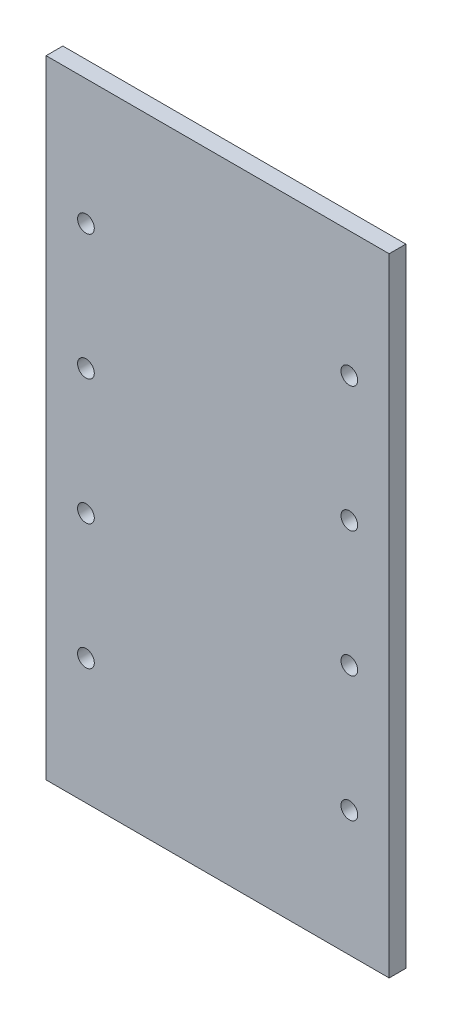
ISO-10303-21;
HEADER;
FILE_DESCRIPTION(('STEP AP214'),'2;1');
FILE_NAME('part.step','',(''),(''),'','','');
FILE_SCHEMA(('AUTOMOTIVE_DESIGN { 1 0 10303 214 1 1 1 1 }'));
ENDSEC;
DATA;
#1=APPLICATION_CONTEXT('core data for automotive mechanical design processes');
#2=APPLICATION_PROTOCOL_DEFINITION('international standard','automotive_design',2000,#1);
#3=PRODUCT_CONTEXT('',#1,'mechanical');
#4=PRODUCT('Part','Part','',(#3));
#5=PRODUCT_RELATED_PRODUCT_CATEGORY('part','',(#4));
#6=PRODUCT_DEFINITION_FORMATION('','',#4);
#7=PRODUCT_DEFINITION_CONTEXT('part definition',#1,'design');
#8=PRODUCT_DEFINITION('design','',#6,#7);
#9=PRODUCT_DEFINITION_SHAPE('','',#8);
#10=(LENGTH_UNIT() NAMED_UNIT(*) SI_UNIT(.MILLI.,.METRE.));
#11=(NAMED_UNIT(*) PLANE_ANGLE_UNIT() SI_UNIT($,.RADIAN.));
#12=(NAMED_UNIT(*) SI_UNIT($,.STERADIAN.) SOLID_ANGLE_UNIT());
#13=UNCERTAINTY_MEASURE_WITH_UNIT(LENGTH_MEASURE(1.E-05),#10,'distance_accuracy_value','');
#14=(GEOMETRIC_REPRESENTATION_CONTEXT(3) GLOBAL_UNCERTAINTY_ASSIGNED_CONTEXT((#13)) GLOBAL_UNIT_ASSIGNED_CONTEXT((#10,
#11,#12)) REPRESENTATION_CONTEXT('',''));
#15=CARTESIAN_POINT('',(0.,0.,0.));
#16=DIRECTION('',(0.,0.,1.));
#17=DIRECTION('',(1.,0.,0.));
#18=AXIS2_PLACEMENT_3D('',#15,#16,#17);
#19=CARTESIAN_POINT('',(19.05,0.,4.));
#20=DIRECTION('',(0.,0.,-1.));
#21=DIRECTION('',(-1.,0.,0.));
#22=AXIS2_PLACEMENT_3D('',#19,#20,#21);
#23=PLANE('',#22);
#24=CARTESIAN_POINT('',(9.5249999999999,30.,4.));
#25=DIRECTION('',(0.,0.,1.));
#26=DIRECTION('',(1.,0.,0.));
#27=AXIS2_PLACEMENT_3D('',#24,#25,#26);
#28=CIRCLE('',#27,2.);
#29=CARTESIAN_POINT('',(11.5249999999999,30.,4.));
#30=VERTEX_POINT('',#29);
#31=EDGE_CURVE('E151',#30,#30,#28,.T.);
#32=ORIENTED_EDGE('',*,*,#31,.F.);
#33=EDGE_LOOP('',(#32));
#34=FACE_BOUND('',#33,.T.);
#35=CARTESIAN_POINT('',(9.52499999999979,60.,4.));
#36=DIRECTION('',(0.,0.,1.));
#37=DIRECTION('',(1.,0.,0.));
#38=AXIS2_PLACEMENT_3D('',#35,#36,#37);
#39=CIRCLE('',#38,2.);
#40=CARTESIAN_POINT('',(11.5249999999998,60.,4.));
#41=VERTEX_POINT('',#40);
#42=EDGE_CURVE('E145',#41,#41,#39,.T.);
#43=ORIENTED_EDGE('',*,*,#42,.F.);
#44=EDGE_LOOP('',(#43));
#45=FACE_BOUND('',#44,.T.);
#46=CARTESIAN_POINT('',(9.52499999999969,90.,4.));
#47=DIRECTION('',(0.,0.,1.));
#48=DIRECTION('',(1.,0.,0.));
#49=AXIS2_PLACEMENT_3D('',#46,#47,#48);
#50=CIRCLE('',#49,2.);
#51=CARTESIAN_POINT('',(11.5249999999997,90.,4.));
#52=VERTEX_POINT('',#51);
#53=EDGE_CURVE('E139',#52,#52,#50,.T.);
#54=ORIENTED_EDGE('',*,*,#53,.F.);
#55=EDGE_LOOP('',(#54));
#56=FACE_BOUND('',#55,.T.);
#57=CARTESIAN_POINT('',(9.52499999999958,120.,4.));
#58=DIRECTION('',(0.,0.,1.));
#59=DIRECTION('',(1.,0.,0.));
#60=AXIS2_PLACEMENT_3D('',#57,#58,#59);
#61=CIRCLE('',#60,2.);
#62=CARTESIAN_POINT('',(11.5249999999996,120.,4.));
#63=VERTEX_POINT('',#62);
#64=EDGE_CURVE('E133',#63,#63,#61,.T.);
#65=ORIENTED_EDGE('',*,*,#64,.F.);
#66=EDGE_LOOP('',(#65));
#67=FACE_BOUND('',#66,.T.);
#68=CARTESIAN_POINT('',(-53.4669999999998,60.,4.));
#69=DIRECTION('',(0.,0.,-1.));
#70=DIRECTION('',(-1.,0.,0.));
#71=AXIS2_PLACEMENT_3D('',#68,#69,#70);
#72=CIRCLE('',#71,2.);
#73=CARTESIAN_POINT('',(-55.4669999999998,60.,4.));
#74=VERTEX_POINT('',#73);
#75=EDGE_CURVE('E121',#74,#74,#72,.T.);
#76=ORIENTED_EDGE('',*,*,#75,.T.);
#77=EDGE_LOOP('',(#76));
#78=FACE_BOUND('',#77,.T.);
#79=CARTESIAN_POINT('',(-53.4669999999996,120.,4.));
#80=DIRECTION('',(0.,0.,-1.));
#81=DIRECTION('',(-1.,0.,0.));
#82=AXIS2_PLACEMENT_3D('',#79,#80,#81);
#83=CIRCLE('',#82,2.00000000000001);
#84=CARTESIAN_POINT('',(-55.4669999999996,120.,4.));
#85=VERTEX_POINT('',#84);
#86=EDGE_CURVE('E112',#85,#85,#83,.T.);
#87=ORIENTED_EDGE('',*,*,#86,.T.);
#88=EDGE_LOOP('',(#87));
#89=FACE_BOUND('',#88,.T.);
#90=DIRECTION('',(0.,1.,0.));
#91=VECTOR('',#90,1.);
#92=CARTESIAN_POINT('',(19.05,150.,4.));
#93=LINE('',#92,#91);
#94=CARTESIAN_POINT('',(19.05,0.,4.));
#95=VERTEX_POINT('',#94);
#96=CARTESIAN_POINT('',(19.05,150.,4.));
#97=VERTEX_POINT('',#96);
#98=EDGE_CURVE('E85',#95,#97,#93,.T.);
#99=ORIENTED_EDGE('',*,*,#98,.T.);
#100=DIRECTION('',(-1.,0.,0.));
#101=VECTOR('',#100,1.);
#102=CARTESIAN_POINT('',(19.05,150.,4.));
#103=LINE('',#102,#101);
#104=CARTESIAN_POINT('',(-62.992,150.,4.));
#105=VERTEX_POINT('',#104);
#106=EDGE_CURVE('E80',#97,#105,#103,.T.);
#107=ORIENTED_EDGE('',*,*,#106,.T.);
#108=DIRECTION('',(0.,-1.,0.));
#109=VECTOR('',#108,1.);
#110=CARTESIAN_POINT('',(-62.992,150.,4.));
#111=LINE('',#110,#109);
#112=CARTESIAN_POINT('',(-62.992,0.,4.));
#113=VERTEX_POINT('',#112);
#114=EDGE_CURVE('E83',#105,#113,#111,.T.);
#115=ORIENTED_EDGE('',*,*,#114,.T.);
#116=DIRECTION('',(1.,0.,0.));
#117=VECTOR('',#116,1.);
#118=CARTESIAN_POINT('',(19.05,0.,4.));
#119=LINE('',#118,#117);
#120=EDGE_CURVE('E50',#113,#95,#119,.T.);
#121=ORIENTED_EDGE('',*,*,#120,.T.);
#122=EDGE_LOOP('',(#99,#107,#115,#121));
#123=FACE_BOUND('',#122,.T.);
#124=CARTESIAN_POINT('',(-53.4669999999997,90.,4.));
#125=DIRECTION('',(0.,0.,-1.));
#126=DIRECTION('',(-1.,0.,0.));
#127=AXIS2_PLACEMENT_3D('',#124,#125,#126);
#128=CIRCLE('',#127,2.);
#129=CARTESIAN_POINT('',(-55.4669999999997,90.,4.));
#130=VERTEX_POINT('',#129);
#131=EDGE_CURVE('E115',#130,#130,#128,.T.);
#132=ORIENTED_EDGE('',*,*,#131,.T.);
#133=EDGE_LOOP('',(#132));
#134=FACE_BOUND('',#133,.T.);
#135=CARTESIAN_POINT('',(-53.4669999999999,30.,4.));
#136=DIRECTION('',(0.,0.,-1.));
#137=DIRECTION('',(-1.,0.,0.));
#138=AXIS2_PLACEMENT_3D('',#135,#136,#137);
#139=CIRCLE('',#138,1.99999999999999);
#140=CARTESIAN_POINT('',(-55.4669999999999,30.,4.));
#141=VERTEX_POINT('',#140);
#142=EDGE_CURVE('E127',#141,#141,#139,.T.);
#143=ORIENTED_EDGE('',*,*,#142,.T.);
#144=EDGE_LOOP('',(#143));
#145=FACE_BOUND('',#144,.T.);
#146=ADVANCED_FACE('F33',(#34,#45,#56,#67,#78,#89,#123,#134,#145),#23,.F.);
#147=CARTESIAN_POINT('',(19.05,0.,0.));
#148=DIRECTION('',(0.,0.,-1.));
#149=DIRECTION('',(-1.,0.,0.));
#150=AXIS2_PLACEMENT_3D('',#147,#148,#149);
#151=PLANE('',#150);
#152=CARTESIAN_POINT('',(9.5249999999999,30.,0.));
#153=DIRECTION('',(0.,0.,1.));
#154=DIRECTION('',(1.,0.,0.));
#155=AXIS2_PLACEMENT_3D('',#152,#153,#154);
#156=CIRCLE('',#155,2.);
#157=CARTESIAN_POINT('',(11.5249999999999,30.,0.));
#158=VERTEX_POINT('',#157);
#159=EDGE_CURVE('E154',#158,#158,#156,.T.);
#160=ORIENTED_EDGE('',*,*,#159,.T.);
#161=EDGE_LOOP('',(#160));
#162=FACE_BOUND('',#161,.T.);
#163=CARTESIAN_POINT('',(9.52499999999979,60.,0.));
#164=DIRECTION('',(0.,0.,1.));
#165=DIRECTION('',(1.,0.,0.));
#166=AXIS2_PLACEMENT_3D('',#163,#164,#165);
#167=CIRCLE('',#166,2.);
#168=CARTESIAN_POINT('',(11.5249999999998,60.,0.));
#169=VERTEX_POINT('',#168);
#170=EDGE_CURVE('E148',#169,#169,#167,.T.);
#171=ORIENTED_EDGE('',*,*,#170,.T.);
#172=EDGE_LOOP('',(#171));
#173=FACE_BOUND('',#172,.T.);
#174=CARTESIAN_POINT('',(9.52499999999969,90.,0.));
#175=DIRECTION('',(0.,0.,1.));
#176=DIRECTION('',(1.,0.,0.));
#177=AXIS2_PLACEMENT_3D('',#174,#175,#176);
#178=CIRCLE('',#177,2.);
#179=CARTESIAN_POINT('',(11.5249999999997,90.,0.));
#180=VERTEX_POINT('',#179);
#181=EDGE_CURVE('E142',#180,#180,#178,.T.);
#182=ORIENTED_EDGE('',*,*,#181,.T.);
#183=EDGE_LOOP('',(#182));
#184=FACE_BOUND('',#183,.T.);
#185=CARTESIAN_POINT('',(9.52499999999958,120.,0.));
#186=DIRECTION('',(0.,0.,1.));
#187=DIRECTION('',(1.,0.,0.));
#188=AXIS2_PLACEMENT_3D('',#185,#186,#187);
#189=CIRCLE('',#188,2.);
#190=CARTESIAN_POINT('',(11.5249999999996,120.,0.));
#191=VERTEX_POINT('',#190);
#192=EDGE_CURVE('E136',#191,#191,#189,.T.);
#193=ORIENTED_EDGE('',*,*,#192,.T.);
#194=EDGE_LOOP('',(#193));
#195=FACE_BOUND('',#194,.T.);
#196=CARTESIAN_POINT('',(-53.4669999999998,60.,0.));
#197=DIRECTION('',(0.,0.,-1.));
#198=DIRECTION('',(-1.,0.,0.));
#199=AXIS2_PLACEMENT_3D('',#196,#197,#198);
#200=CIRCLE('',#199,2.);
#201=CARTESIAN_POINT('',(-55.4669999999998,60.,0.));
#202=VERTEX_POINT('',#201);
#203=EDGE_CURVE('E124',#202,#202,#200,.T.);
#204=ORIENTED_EDGE('',*,*,#203,.F.);
#205=EDGE_LOOP('',(#204));
#206=FACE_BOUND('',#205,.T.);
#207=CARTESIAN_POINT('',(-53.4669999999996,120.,0.));
#208=DIRECTION('',(0.,0.,-1.));
#209=DIRECTION('',(-1.,0.,0.));
#210=AXIS2_PLACEMENT_3D('',#207,#208,#209);
#211=CIRCLE('',#210,2.00000000000001);
#212=CARTESIAN_POINT('',(-55.4669999999996,120.,0.));
#213=VERTEX_POINT('',#212);
#214=EDGE_CURVE('E100',#213,#213,#211,.T.);
#215=ORIENTED_EDGE('',*,*,#214,.F.);
#216=EDGE_LOOP('',(#215));
#217=FACE_BOUND('',#216,.T.);
#218=DIRECTION('',(0.,1.,0.));
#219=VECTOR('',#218,1.);
#220=CARTESIAN_POINT('',(19.05,150.,0.));
#221=LINE('',#220,#219);
#222=CARTESIAN_POINT('',(19.05,0.,0.));
#223=VERTEX_POINT('',#222);
#224=CARTESIAN_POINT('',(19.05,150.,0.));
#225=VERTEX_POINT('',#224);
#226=EDGE_CURVE('E97',#223,#225,#221,.T.);
#227=ORIENTED_EDGE('',*,*,#226,.F.);
#228=DIRECTION('',(1.,0.,0.));
#229=VECTOR('',#228,1.);
#230=CARTESIAN_POINT('',(19.05,0.,0.));
#231=LINE('',#230,#229);
#232=CARTESIAN_POINT('',(-62.992,0.,0.));
#233=VERTEX_POINT('',#232);
#234=EDGE_CURVE('E73',#233,#223,#231,.T.);
#235=ORIENTED_EDGE('',*,*,#234,.F.);
#236=DIRECTION('',(0.,-1.,0.));
#237=VECTOR('',#236,1.);
#238=CARTESIAN_POINT('',(-62.992,150.,0.));
#239=LINE('',#238,#237);
#240=CARTESIAN_POINT('',(-62.992,150.,0.));
#241=VERTEX_POINT('',#240);
#242=EDGE_CURVE('E67',#241,#233,#239,.T.);
#243=ORIENTED_EDGE('',*,*,#242,.F.);
#244=DIRECTION('',(-1.,0.,0.));
#245=VECTOR('',#244,1.);
#246=CARTESIAN_POINT('',(19.05,150.,0.));
#247=LINE('',#246,#245);
#248=EDGE_CURVE('E89',#225,#241,#247,.T.);
#249=ORIENTED_EDGE('',*,*,#248,.F.);
#250=EDGE_LOOP('',(#227,#235,#243,#249));
#251=FACE_BOUND('',#250,.T.);
#252=CARTESIAN_POINT('',(-53.4669999999997,90.,0.));
#253=DIRECTION('',(0.,0.,-1.));
#254=DIRECTION('',(-1.,0.,0.));
#255=AXIS2_PLACEMENT_3D('',#252,#253,#254);
#256=CIRCLE('',#255,2.);
#257=CARTESIAN_POINT('',(-55.4669999999997,90.,0.));
#258=VERTEX_POINT('',#257);
#259=EDGE_CURVE('E118',#258,#258,#256,.T.);
#260=ORIENTED_EDGE('',*,*,#259,.F.);
#261=EDGE_LOOP('',(#260));
#262=FACE_BOUND('',#261,.T.);
#263=CARTESIAN_POINT('',(-53.4669999999999,30.,0.));
#264=DIRECTION('',(0.,0.,-1.));
#265=DIRECTION('',(-1.,0.,0.));
#266=AXIS2_PLACEMENT_3D('',#263,#264,#265);
#267=CIRCLE('',#266,1.99999999999999);
#268=CARTESIAN_POINT('',(-55.4669999999999,30.,0.));
#269=VERTEX_POINT('',#268);
#270=EDGE_CURVE('E130',#269,#269,#267,.T.);
#271=ORIENTED_EDGE('',*,*,#270,.F.);
#272=EDGE_LOOP('',(#271));
#273=FACE_BOUND('',#272,.T.);
#274=ADVANCED_FACE('F108',(#162,#173,#184,#195,#206,#217,#251,#262,#273),#151,.T.);
#275=CARTESIAN_POINT('',(19.05,150.,4.));
#276=DIRECTION('',(-1.,0.,0.));
#277=DIRECTION('',(0.,0.,1.));
#278=AXIS2_PLACEMENT_3D('',#275,#276,#277);
#279=PLANE('',#278);
#280=ORIENTED_EDGE('',*,*,#226,.T.);
#281=DIRECTION('',(0.,0.,-1.));
#282=VECTOR('',#281,1.);
#283=CARTESIAN_POINT('',(19.05,150.,4.));
#284=LINE('',#283,#282);
#285=EDGE_CURVE('E11',#97,#225,#284,.T.);
#286=ORIENTED_EDGE('',*,*,#285,.F.);
#287=ORIENTED_EDGE('',*,*,#98,.F.);
#288=DIRECTION('',(0.,0.,-1.));
#289=VECTOR('',#288,1.);
#290=CARTESIAN_POINT('',(19.05,0.,4.));
#291=LINE('',#290,#289);
#292=EDGE_CURVE('E93',#95,#223,#291,.T.);
#293=ORIENTED_EDGE('',*,*,#292,.T.);
#294=EDGE_LOOP('',(#280,#286,#287,#293));
#295=FACE_BOUND('',#294,.T.);
#296=ADVANCED_FACE('F35',(#295),#279,.F.);
#297=CARTESIAN_POINT('',(19.05,150.,4.));
#298=DIRECTION('',(0.,-1.,0.));
#299=DIRECTION('',(0.,0.,-1.));
#300=AXIS2_PLACEMENT_3D('',#297,#298,#299);
#301=PLANE('',#300);
#302=ORIENTED_EDGE('',*,*,#248,.T.);
#303=DIRECTION('',(0.,0.,-1.));
#304=VECTOR('',#303,1.);
#305=CARTESIAN_POINT('',(-62.992,150.,4.));
#306=LINE('',#305,#304);
#307=EDGE_CURVE('E42',#105,#241,#306,.T.);
#308=ORIENTED_EDGE('',*,*,#307,.F.);
#309=ORIENTED_EDGE('',*,*,#106,.F.);
#310=ORIENTED_EDGE('',*,*,#285,.T.);
#311=EDGE_LOOP('',(#302,#308,#309,#310));
#312=FACE_BOUND('',#311,.T.);
#313=ADVANCED_FACE('F88',(#312),#301,.F.);
#314=CARTESIAN_POINT('',(-62.992,150.,4.));
#315=DIRECTION('',(1.,0.,0.));
#316=DIRECTION('',(0.,0.,-1.));
#317=AXIS2_PLACEMENT_3D('',#314,#315,#316);
#318=PLANE('',#317);
#319=ORIENTED_EDGE('',*,*,#242,.T.);
#320=DIRECTION('',(0.,0.,-1.));
#321=VECTOR('',#320,1.);
#322=CARTESIAN_POINT('',(-62.992,0.,4.));
#323=LINE('',#322,#321);
#324=EDGE_CURVE('E90',#113,#233,#323,.T.);
#325=ORIENTED_EDGE('',*,*,#324,.F.);
#326=ORIENTED_EDGE('',*,*,#114,.F.);
#327=ORIENTED_EDGE('',*,*,#307,.T.);
#328=EDGE_LOOP('',(#319,#325,#326,#327));
#329=FACE_BOUND('',#328,.T.);
#330=ADVANCED_FACE('F91',(#329),#318,.F.);
#331=CARTESIAN_POINT('',(19.05,0.,4.));
#332=DIRECTION('',(0.,1.,0.));
#333=DIRECTION('',(0.,0.,1.));
#334=AXIS2_PLACEMENT_3D('',#331,#332,#333);
#335=PLANE('',#334);
#336=ORIENTED_EDGE('',*,*,#234,.T.);
#337=ORIENTED_EDGE('',*,*,#292,.F.);
#338=ORIENTED_EDGE('',*,*,#120,.F.);
#339=ORIENTED_EDGE('',*,*,#324,.T.);
#340=EDGE_LOOP('',(#336,#337,#338,#339));
#341=FACE_BOUND('',#340,.T.);
#342=ADVANCED_FACE('F105',(#341),#335,.F.);
#343=CARTESIAN_POINT('',(-53.4669999999996,120.,0.));
#344=DIRECTION('',(0.,0.,1.));
#345=DIRECTION('',(1.,0.,0.));
#346=AXIS2_PLACEMENT_3D('',#343,#344,#345);
#347=CYLINDRICAL_SURFACE('',#346,2.00000000000001);
#348=ORIENTED_EDGE('',*,*,#214,.T.);
#349=EDGE_LOOP('',(#348));
#350=FACE_BOUND('',#349,.T.);
#351=ORIENTED_EDGE('',*,*,#86,.F.);
#352=EDGE_LOOP('',(#351));
#353=FACE_BOUND('',#352,.T.);
#354=ADVANCED_FACE('F175',(#350,#353),#347,.F.);
#355=CARTESIAN_POINT('',(-53.4669999999997,90.,0.));
#356=DIRECTION('',(0.,0.,1.));
#357=DIRECTION('',(1.,0.,0.));
#358=AXIS2_PLACEMENT_3D('',#355,#356,#357);
#359=CYLINDRICAL_SURFACE('',#358,2.);
#360=ORIENTED_EDGE('',*,*,#259,.T.);
#361=EDGE_LOOP('',(#360));
#362=FACE_BOUND('',#361,.T.);
#363=ORIENTED_EDGE('',*,*,#131,.F.);
#364=EDGE_LOOP('',(#363));
#365=FACE_BOUND('',#364,.T.);
#366=ADVANCED_FACE('F177',(#362,#365),#359,.F.);
#367=CARTESIAN_POINT('',(-53.4669999999998,60.,0.));
#368=DIRECTION('',(0.,0.,1.));
#369=DIRECTION('',(1.,0.,0.));
#370=AXIS2_PLACEMENT_3D('',#367,#368,#369);
#371=CYLINDRICAL_SURFACE('',#370,2.);
#372=ORIENTED_EDGE('',*,*,#203,.T.);
#373=EDGE_LOOP('',(#372));
#374=FACE_BOUND('',#373,.T.);
#375=ORIENTED_EDGE('',*,*,#75,.F.);
#376=EDGE_LOOP('',(#375));
#377=FACE_BOUND('',#376,.T.);
#378=ADVANCED_FACE('F184',(#374,#377),#371,.F.);
#379=CARTESIAN_POINT('',(-53.4669999999999,30.,0.));
#380=DIRECTION('',(0.,0.,1.));
#381=DIRECTION('',(1.,0.,0.));
#382=AXIS2_PLACEMENT_3D('',#379,#380,#381);
#383=CYLINDRICAL_SURFACE('',#382,1.99999999999999);
#384=ORIENTED_EDGE('',*,*,#270,.T.);
#385=EDGE_LOOP('',(#384));
#386=FACE_BOUND('',#385,.T.);
#387=ORIENTED_EDGE('',*,*,#142,.F.);
#388=EDGE_LOOP('',(#387));
#389=FACE_BOUND('',#388,.T.);
#390=ADVANCED_FACE('F247',(#386,#389),#383,.F.);
#391=CARTESIAN_POINT('',(9.52499999999958,120.,0.));
#392=DIRECTION('',(0.,0.,1.));
#393=DIRECTION('',(1.,0.,0.));
#394=AXIS2_PLACEMENT_3D('',#391,#392,#393);
#395=CYLINDRICAL_SURFACE('',#394,2.);
#396=ORIENTED_EDGE('',*,*,#192,.F.);
#397=EDGE_LOOP('',(#396));
#398=FACE_BOUND('',#397,.T.);
#399=ORIENTED_EDGE('',*,*,#64,.T.);
#400=EDGE_LOOP('',(#399));
#401=FACE_BOUND('',#400,.T.);
#402=ADVANCED_FACE('F255',(#398,#401),#395,.F.);
#403=CARTESIAN_POINT('',(9.52499999999969,90.,0.));
#404=DIRECTION('',(0.,0.,1.));
#405=DIRECTION('',(1.,0.,0.));
#406=AXIS2_PLACEMENT_3D('',#403,#404,#405);
#407=CYLINDRICAL_SURFACE('',#406,2.);
#408=ORIENTED_EDGE('',*,*,#181,.F.);
#409=EDGE_LOOP('',(#408));
#410=FACE_BOUND('',#409,.T.);
#411=ORIENTED_EDGE('',*,*,#53,.T.);
#412=EDGE_LOOP('',(#411));
#413=FACE_BOUND('',#412,.T.);
#414=ADVANCED_FACE('F264',(#410,#413),#407,.F.);
#415=CARTESIAN_POINT('',(9.52499999999979,60.,0.));
#416=DIRECTION('',(0.,0.,1.));
#417=DIRECTION('',(1.,0.,0.));
#418=AXIS2_PLACEMENT_3D('',#415,#416,#417);
#419=CYLINDRICAL_SURFACE('',#418,2.);
#420=ORIENTED_EDGE('',*,*,#170,.F.);
#421=EDGE_LOOP('',(#420));
#422=FACE_BOUND('',#421,.T.);
#423=ORIENTED_EDGE('',*,*,#42,.T.);
#424=EDGE_LOOP('',(#423));
#425=FACE_BOUND('',#424,.T.);
#426=ADVANCED_FACE('F273',(#422,#425),#419,.F.);
#427=CARTESIAN_POINT('',(9.5249999999999,30.,0.));
#428=DIRECTION('',(0.,0.,1.));
#429=DIRECTION('',(1.,0.,0.));
#430=AXIS2_PLACEMENT_3D('',#427,#428,#429);
#431=CYLINDRICAL_SURFACE('',#430,2.);
#432=ORIENTED_EDGE('',*,*,#159,.F.);
#433=EDGE_LOOP('',(#432));
#434=FACE_BOUND('',#433,.T.);
#435=ORIENTED_EDGE('',*,*,#31,.T.);
#436=EDGE_LOOP('',(#435));
#437=FACE_BOUND('',#436,.T.);
#438=ADVANCED_FACE('F160',(#434,#437),#431,.F.);
#439=CLOSED_SHELL('',(#146,#274,#296,#313,#330,#342,#354,#366,#378,#390,#402,#414,#426,#438));
#440=MANIFOLD_SOLID_BREP('B2',#439);
#441=ADVANCED_BREP_SHAPE_REPRESENTATION('',(#18,#440),#14);
#442=SHAPE_DEFINITION_REPRESENTATION(#9,#441);
ENDSEC;
END-ISO-10303-21;
